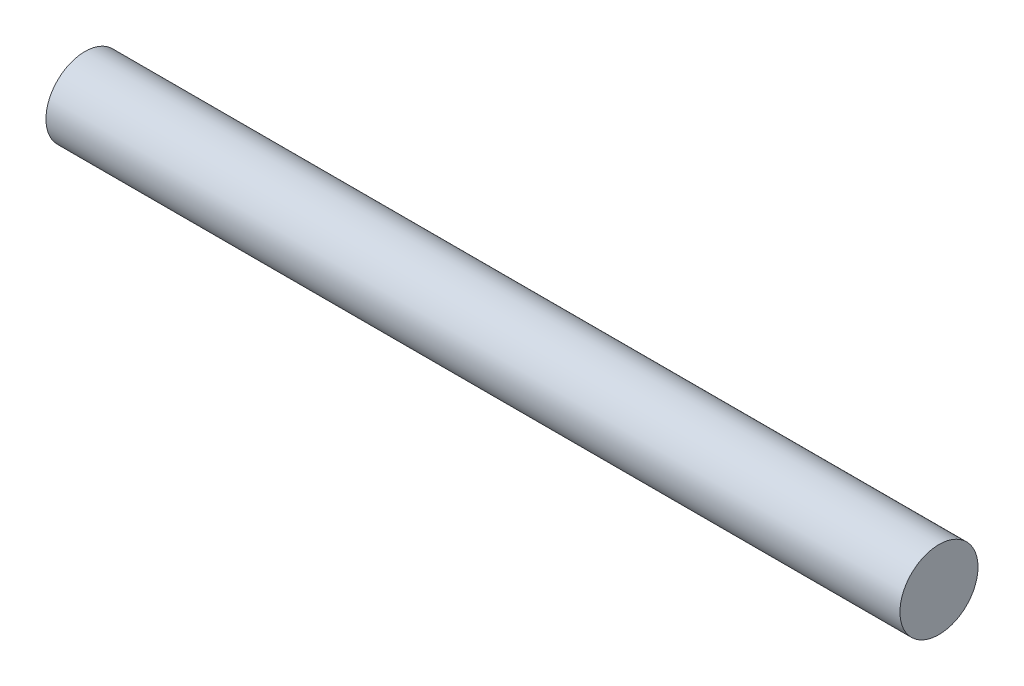
ISO-10303-21;
HEADER;
FILE_DESCRIPTION(('STEP AP214'),'2;1');
FILE_NAME('part.step','',(''),(''),'','','');
FILE_SCHEMA(('AUTOMOTIVE_DESIGN { 1 0 10303 214 1 1 1 1 }'));
ENDSEC;
DATA;
#1=APPLICATION_CONTEXT('core data for automotive mechanical design processes');
#2=APPLICATION_PROTOCOL_DEFINITION('international standard','automotive_design',2000,#1);
#3=PRODUCT_CONTEXT('',#1,'mechanical');
#4=PRODUCT('Part','Part','',(#3));
#5=PRODUCT_RELATED_PRODUCT_CATEGORY('part','',(#4));
#6=PRODUCT_DEFINITION_FORMATION('','',#4);
#7=PRODUCT_DEFINITION_CONTEXT('part definition',#1,'design');
#8=PRODUCT_DEFINITION('design','',#6,#7);
#9=PRODUCT_DEFINITION_SHAPE('','',#8);
#10=(LENGTH_UNIT() NAMED_UNIT(*) SI_UNIT(.MILLI.,.METRE.));
#11=(NAMED_UNIT(*) PLANE_ANGLE_UNIT() SI_UNIT($,.RADIAN.));
#12=(NAMED_UNIT(*) SI_UNIT($,.STERADIAN.) SOLID_ANGLE_UNIT());
#13=UNCERTAINTY_MEASURE_WITH_UNIT(LENGTH_MEASURE(1.E-05),#10,'distance_accuracy_value','');
#14=(GEOMETRIC_REPRESENTATION_CONTEXT(3) GLOBAL_UNCERTAINTY_ASSIGNED_CONTEXT((#13)) GLOBAL_UNIT_ASSIGNED_CONTEXT((#10,
#11,#12)) REPRESENTATION_CONTEXT('',''));
#15=CARTESIAN_POINT('',(0.,0.,0.));
#16=DIRECTION('',(0.,0.,1.));
#17=DIRECTION('',(1.,0.,0.));
#18=AXIS2_PLACEMENT_3D('',#15,#16,#17);
#19=CARTESIAN_POINT('',(35.,0.,0.));
#20=DIRECTION('',(-1.,0.,0.));
#21=DIRECTION('',(0.,0.,1.));
#22=AXIS2_PLACEMENT_3D('',#19,#20,#21);
#23=CYLINDRICAL_SURFACE('',#22,1.6);
#24=CARTESIAN_POINT('',(35.,0.,0.));
#25=DIRECTION('',(1.,0.,0.));
#26=DIRECTION('',(0.,0.,-1.));
#27=AXIS2_PLACEMENT_3D('',#24,#25,#26);
#28=CIRCLE('',#27,1.6);
#29=CARTESIAN_POINT('',(35.,0.,-1.6));
#30=VERTEX_POINT('',#29);
#31=EDGE_CURVE('E10',#30,#30,#28,.T.);
#32=ORIENTED_EDGE('',*,*,#31,.F.);
#33=EDGE_LOOP('',(#32));
#34=FACE_BOUND('',#33,.T.);
#35=CARTESIAN_POINT('',(0.,0.,0.));
#36=DIRECTION('',(1.,0.,0.));
#37=DIRECTION('',(0.,0.,-1.));
#38=AXIS2_PLACEMENT_3D('',#35,#36,#37);
#39=CIRCLE('',#38,1.6);
#40=CARTESIAN_POINT('',(0.,0.,-1.6));
#41=VERTEX_POINT('',#40);
#42=EDGE_CURVE('E34',#41,#41,#39,.T.);
#43=ORIENTED_EDGE('',*,*,#42,.T.);
#44=EDGE_LOOP('',(#43));
#45=FACE_BOUND('',#44,.T.);
#46=ADVANCED_FACE('F31',(#34,#45),#23,.T.);
#47=CARTESIAN_POINT('',(35.,0.,0.));
#48=DIRECTION('',(1.,0.,0.));
#49=DIRECTION('',(0.,0.,-1.));
#50=AXIS2_PLACEMENT_3D('',#47,#48,#49);
#51=PLANE('',#50);
#52=ORIENTED_EDGE('',*,*,#31,.T.);
#53=EDGE_LOOP('',(#52));
#54=FACE_BOUND('',#53,.T.);
#55=ADVANCED_FACE('F46',(#54),#51,.T.);
#56=CARTESIAN_POINT('',(0.,0.,0.));
#57=DIRECTION('',(1.,0.,0.));
#58=DIRECTION('',(0.,0.,-1.));
#59=AXIS2_PLACEMENT_3D('',#56,#57,#58);
#60=PLANE('',#59);
#61=ORIENTED_EDGE('',*,*,#42,.F.);
#62=EDGE_LOOP('',(#61));
#63=FACE_BOUND('',#62,.T.);
#64=ADVANCED_FACE('F44',(#63),#60,.F.);
#65=CLOSED_SHELL('',(#46,#55,#64));
#66=MANIFOLD_SOLID_BREP('B2',#65);
#67=ADVANCED_BREP_SHAPE_REPRESENTATION('',(#18,#66),#14);
#68=SHAPE_DEFINITION_REPRESENTATION(#9,#67);
ENDSEC;
END-ISO-10303-21;
